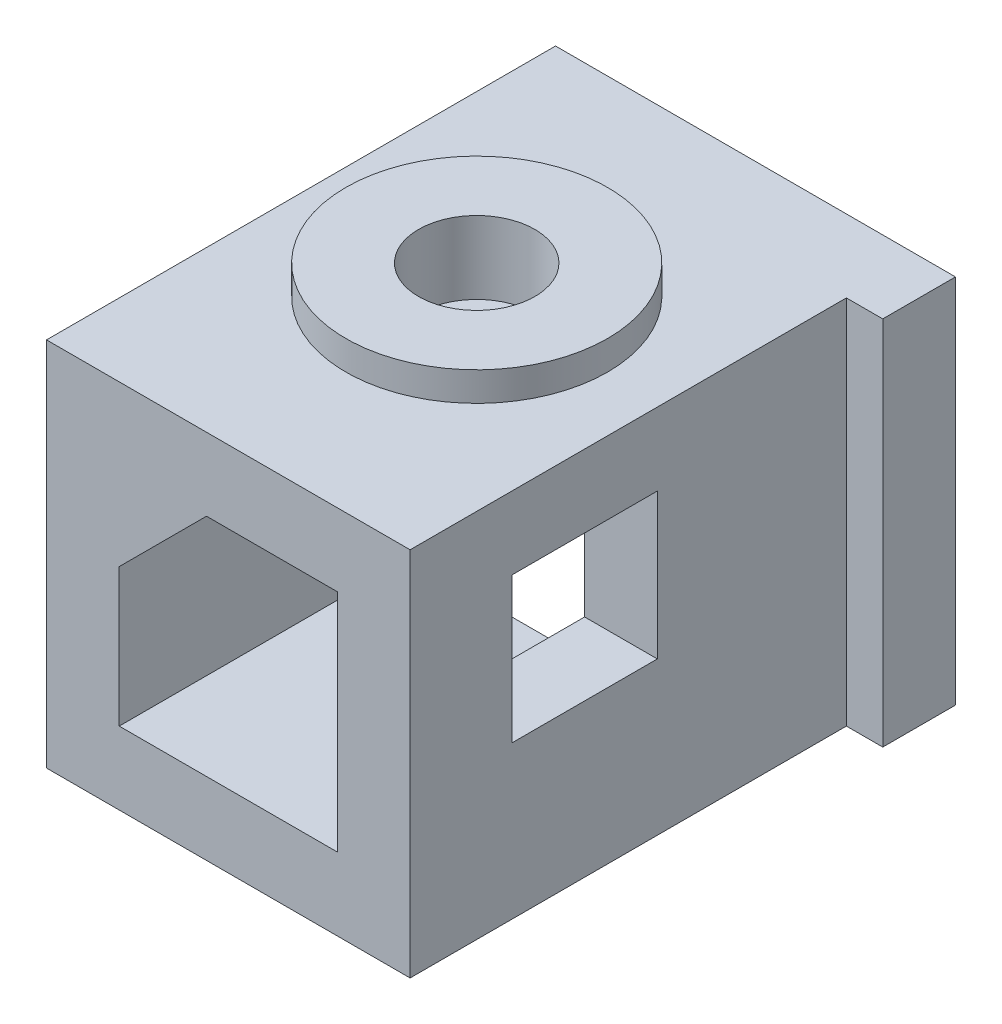
ISO-10303-21;
HEADER;
FILE_DESCRIPTION(('STEP AP214'),'2;1');
FILE_NAME('part.step','',(''),(''),'','','');
FILE_SCHEMA(('AUTOMOTIVE_DESIGN { 1 0 10303 214 1 1 1 1 }'));
ENDSEC;
DATA;
#1=APPLICATION_CONTEXT('core data for automotive mechanical design processes');
#2=APPLICATION_PROTOCOL_DEFINITION('international standard','automotive_design',2000,#1);
#3=PRODUCT_CONTEXT('',#1,'mechanical');
#4=PRODUCT('Part','Part','',(#3));
#5=PRODUCT_RELATED_PRODUCT_CATEGORY('part','',(#4));
#6=PRODUCT_DEFINITION_FORMATION('','',#4);
#7=PRODUCT_DEFINITION_CONTEXT('part definition',#1,'design');
#8=PRODUCT_DEFINITION('design','',#6,#7);
#9=PRODUCT_DEFINITION_SHAPE('','',#8);
#10=(LENGTH_UNIT() NAMED_UNIT(*) SI_UNIT(.MILLI.,.METRE.));
#11=(NAMED_UNIT(*) PLANE_ANGLE_UNIT() SI_UNIT($,.RADIAN.));
#12=(NAMED_UNIT(*) SI_UNIT($,.STERADIAN.) SOLID_ANGLE_UNIT());
#13=UNCERTAINTY_MEASURE_WITH_UNIT(LENGTH_MEASURE(1.E-05),#10,'distance_accuracy_value','');
#14=(GEOMETRIC_REPRESENTATION_CONTEXT(3) GLOBAL_UNCERTAINTY_ASSIGNED_CONTEXT((#13)) GLOBAL_UNIT_ASSIGNED_CONTEXT((#10,
#11,#12)) REPRESENTATION_CONTEXT('',''));
#15=CARTESIAN_POINT('',(0.,0.,0.));
#16=DIRECTION('',(0.,0.,1.));
#17=DIRECTION('',(1.,0.,0.));
#18=AXIS2_PLACEMENT_3D('',#15,#16,#17);
#19=CARTESIAN_POINT('',(-4.30557410186496,-6.26438847045866,35.));
#20=DIRECTION('',(-1.,0.,0.));
#21=DIRECTION('',(0.,-1.,0.));
#22=AXIS2_PLACEMENT_3D('',#19,#20,#21);
#23=PLANE('',#22);
#24=DIRECTION('',(0.,0.,1.));
#25=VECTOR('',#24,1.);
#26=CARTESIAN_POINT('',(-4.30557410186496,-15.7643884704587,35.));
#27=LINE('',#26,#25);
#28=CARTESIAN_POINT('',(-4.30557410186496,-15.7643884704587,15.));
#29=VERTEX_POINT('',#28);
#30=CARTESIAN_POINT('',(-4.30557410186496,-15.7643884704587,35.));
#31=VERTEX_POINT('',#30);
#32=EDGE_CURVE('E206',#29,#31,#27,.T.);
#33=ORIENTED_EDGE('',*,*,#32,.F.);
#34=DIRECTION('',(0.,1.,0.));
#35=VECTOR('',#34,1.);
#36=CARTESIAN_POINT('',(-4.30557410186496,-41.379916598547,15.));
#37=LINE('',#36,#35);
#38=CARTESIAN_POINT('',(-4.30557410186496,-13.2643884704587,15.));
#39=VERTEX_POINT('',#38);
#40=EDGE_CURVE('E241',#29,#39,#37,.T.);
#41=ORIENTED_EDGE('',*,*,#40,.T.);
#42=DIRECTION('',(0.,0.,-1.));
#43=VECTOR('',#42,1.);
#44=CARTESIAN_POINT('',(-4.30557410186496,-13.2643884704587,35.));
#45=LINE('',#44,#43);
#46=CARTESIAN_POINT('',(-4.30557410186496,-13.2643884704587,0.));
#47=VERTEX_POINT('',#46);
#48=EDGE_CURVE('E362',#39,#47,#45,.T.);
#49=ORIENTED_EDGE('',*,*,#48,.T.);
#50=DIRECTION('',(0.,1.,0.));
#51=VECTOR('',#50,1.);
#52=CARTESIAN_POINT('',(-4.30557410186496,-6.26438847045866,0.));
#53=LINE('',#52,#51);
#54=CARTESIAN_POINT('',(-4.30557410186496,-6.26438847045866,0.));
#55=VERTEX_POINT('',#54);
#56=EDGE_CURVE('E336',#47,#55,#53,.T.);
#57=ORIENTED_EDGE('',*,*,#56,.T.);
#58=DIRECTION('',(0.,0.,-1.));
#59=VECTOR('',#58,1.);
#60=CARTESIAN_POINT('',(-4.30557410186496,-6.26438847045866,35.));
#61=LINE('',#60,#59);
#62=CARTESIAN_POINT('',(-4.30557410186496,-6.26438847045866,35.));
#63=VERTEX_POINT('',#62);
#64=EDGE_CURVE('E359',#63,#55,#61,.T.);
#65=ORIENTED_EDGE('',*,*,#64,.F.);
#66=DIRECTION('',(0.,1.,0.));
#67=VECTOR('',#66,1.);
#68=CARTESIAN_POINT('',(-4.30557410186496,-6.26438847045866,35.));
#69=LINE('',#68,#67);
#70=EDGE_CURVE('E311',#31,#63,#69,.T.);
#71=ORIENTED_EDGE('',*,*,#70,.F.);
#72=EDGE_LOOP('',(#33,#41,#49,#57,#65,#71));
#73=FACE_BOUND('',#72,.T.);
#74=ADVANCED_FACE('F43',(#73),#23,.F.);
#75=CARTESIAN_POINT('',(10.694425898135,-20.7643884704587,35.));
#76=DIRECTION('',(1.,0.,0.));
#77=DIRECTION('',(0.,1.,0.));
#78=AXIS2_PLACEMENT_3D('',#75,#76,#77);
#79=PLANE('',#78);
#80=DIRECTION('',(0.,0.,1.));
#81=VECTOR('',#80,1.);
#82=CARTESIAN_POINT('',(10.694425898135,-10.2643884704587,28.));
#83=LINE('',#82,#81);
#84=CARTESIAN_POINT('',(10.694425898135,-10.2643884704587,18.));
#85=VERTEX_POINT('',#84);
#86=CARTESIAN_POINT('',(10.694425898135,-10.2643884704587,28.));
#87=VERTEX_POINT('',#86);
#88=EDGE_CURVE('E660',#85,#87,#83,.T.);
#89=ORIENTED_EDGE('',*,*,#88,.F.);
#90=DIRECTION('',(0.,-1.,0.));
#91=VECTOR('',#90,1.);
#92=CARTESIAN_POINT('',(10.694425898135,-0.264388470458658,18.));
#93=LINE('',#92,#91);
#94=CARTESIAN_POINT('',(10.694425898135,-0.264388470458662,18.));
#95=VERTEX_POINT('',#94);
#96=EDGE_CURVE('E227',#95,#85,#93,.T.);
#97=ORIENTED_EDGE('',*,*,#96,.F.);
#98=DIRECTION('',(0.,0.,-1.));
#99=VECTOR('',#98,1.);
#100=CARTESIAN_POINT('',(10.694425898135,-0.264388470458662,35.));
#101=LINE('',#100,#99);
#102=CARTESIAN_POINT('',(10.694425898135,-0.264388470458662,0.));
#103=VERTEX_POINT('',#102);
#104=EDGE_CURVE('E271',#95,#103,#101,.T.);
#105=ORIENTED_EDGE('',*,*,#104,.T.);
#106=DIRECTION('',(0.,1.,0.));
#107=VECTOR('',#106,1.);
#108=CARTESIAN_POINT('',(10.6944258981351,-20.7643884704587,0.));
#109=LINE('',#108,#107);
#110=CARTESIAN_POINT('',(10.6944258981351,-20.7643884704587,0.));
#111=VERTEX_POINT('',#110);
#112=EDGE_CURVE('E285',#111,#103,#109,.T.);
#113=ORIENTED_EDGE('',*,*,#112,.F.);
#114=DIRECTION('',(0.,0.,-1.));
#115=VECTOR('',#114,1.);
#116=CARTESIAN_POINT('',(10.694425898135,-20.7643884704587,35.));
#117=LINE('',#116,#115);
#118=CARTESIAN_POINT('',(10.694425898135,-20.7643884704587,15.));
#119=VERTEX_POINT('',#118);
#120=EDGE_CURVE('E279',#119,#111,#117,.T.);
#121=ORIENTED_EDGE('',*,*,#120,.F.);
#122=DIRECTION('',(0.,1.,0.));
#123=VECTOR('',#122,1.);
#124=CARTESIAN_POINT('',(10.694425898135,-20.7643884704587,15.));
#125=LINE('',#124,#123);
#126=CARTESIAN_POINT('',(10.694425898135,-15.7643884704587,15.));
#127=VERTEX_POINT('',#126);
#128=EDGE_CURVE('E212',#119,#127,#125,.T.);
#129=ORIENTED_EDGE('',*,*,#128,.T.);
#130=DIRECTION('',(0.,0.,1.));
#131=VECTOR('',#130,1.);
#132=CARTESIAN_POINT('',(10.694425898135,-15.7643884704587,35.));
#133=LINE('',#132,#131);
#134=CARTESIAN_POINT('',(10.694425898135,-15.7643884704587,35.));
#135=VERTEX_POINT('',#134);
#136=EDGE_CURVE('E210',#127,#135,#133,.T.);
#137=ORIENTED_EDGE('',*,*,#136,.T.);
#138=DIRECTION('',(0.,1.,0.));
#139=VECTOR('',#138,1.);
#140=CARTESIAN_POINT('',(10.694425898135,-20.7643884704587,35.));
#141=LINE('',#140,#139);
#142=CARTESIAN_POINT('',(10.694425898135,-0.264388470458662,35.));
#143=VERTEX_POINT('',#142);
#144=EDGE_CURVE('E291',#135,#143,#141,.T.);
#145=ORIENTED_EDGE('',*,*,#144,.T.);
#146=CARTESIAN_POINT('',(10.694425898135,-0.264388470458662,28.));
#147=VERTEX_POINT('',#146);
#148=EDGE_CURVE('E276',#143,#147,#101,.T.);
#149=ORIENTED_EDGE('',*,*,#148,.T.);
#150=DIRECTION('',(0.,1.,0.));
#151=VECTOR('',#150,1.);
#152=CARTESIAN_POINT('',(10.694425898135,-0.264388470458658,28.));
#153=LINE('',#152,#151);
#154=EDGE_CURVE('E176',#87,#147,#153,.T.);
#155=ORIENTED_EDGE('',*,*,#154,.F.);
#156=EDGE_LOOP('',(#89,#97,#105,#113,#121,#129,#137,#145,#149,#155));
#157=FACE_BOUND('',#156,.T.);
#158=ADVANCED_FACE('F400',(#157),#79,.F.);
#159=CARTESIAN_POINT('',(-4.30557410186496,-13.2643884704587,35.));
#160=DIRECTION('',(0.,1.,0.));
#161=DIRECTION('',(0.,0.,1.));
#162=AXIS2_PLACEMENT_3D('',#159,#160,#161);
#163=PLANE('',#162);
#164=DIRECTION('',(1.,0.,0.));
#165=VECTOR('',#164,1.);
#166=CARTESIAN_POINT('',(-9.30557410186496,-13.2643884704587,15.));
#167=LINE('',#166,#165);
#168=CARTESIAN_POINT('',(-9.30557410186496,-13.2643884704587,15.));
#169=VERTEX_POINT('',#168);
#170=EDGE_CURVE('E216',#169,#39,#167,.T.);
#171=ORIENTED_EDGE('',*,*,#170,.F.);
#172=DIRECTION('',(0.,0.,-1.));
#173=VECTOR('',#172,1.);
#174=CARTESIAN_POINT('',(-9.30557410186496,-13.2643884704587,35.));
#175=LINE('',#174,#173);
#176=CARTESIAN_POINT('',(-9.30557410186496,-13.2643884704587,0.));
#177=VERTEX_POINT('',#176);
#178=EDGE_CURVE('E47',#169,#177,#175,.T.);
#179=ORIENTED_EDGE('',*,*,#178,.T.);
#180=DIRECTION('',(1.,0.,0.));
#181=VECTOR('',#180,1.);
#182=CARTESIAN_POINT('',(-4.30557410186496,-13.2643884704587,0.));
#183=LINE('',#182,#181);
#184=EDGE_CURVE('E332',#177,#47,#183,.T.);
#185=ORIENTED_EDGE('',*,*,#184,.T.);
#186=ORIENTED_EDGE('',*,*,#48,.F.);
#187=EDGE_LOOP('',(#171,#179,#185,#186));
#188=FACE_BOUND('',#187,.T.);
#189=ADVANCED_FACE('F371',(#188),#163,.F.);
#190=CARTESIAN_POINT('',(15.694425898135,4.73561152954134,35.));
#191=DIRECTION('',(-1.,0.,0.));
#192=DIRECTION('',(0.,0.,1.));
#193=AXIS2_PLACEMENT_3D('',#190,#191,#192);
#194=PLANE('',#193);
#195=DIRECTION('',(0.,0.,1.));
#196=VECTOR('',#195,1.);
#197=CARTESIAN_POINT('',(15.694425898135,-0.264388470458662,28.));
#198=LINE('',#197,#196);
#199=CARTESIAN_POINT('',(15.694425898135,-0.264388470458662,18.));
#200=VERTEX_POINT('',#199);
#201=CARTESIAN_POINT('',(15.694425898135,-0.264388470458662,28.));
#202=VERTEX_POINT('',#201);
#203=EDGE_CURVE('E183',#200,#202,#198,.T.);
#204=ORIENTED_EDGE('',*,*,#203,.F.);
#205=DIRECTION('',(0.,1.,0.));
#206=VECTOR('',#205,1.);
#207=CARTESIAN_POINT('',(15.694425898135,-0.264388470458662,18.));
#208=LINE('',#207,#206);
#209=CARTESIAN_POINT('',(15.694425898135,-10.2643884704587,18.));
#210=VERTEX_POINT('',#209);
#211=EDGE_CURVE('E60',#210,#200,#208,.T.);
#212=ORIENTED_EDGE('',*,*,#211,.F.);
#213=DIRECTION('',(0.,0.,-1.));
#214=VECTOR('',#213,1.);
#215=CARTESIAN_POINT('',(15.694425898135,-10.2643884704587,28.));
#216=LINE('',#215,#214);
#217=CARTESIAN_POINT('',(15.694425898135,-10.2643884704587,28.));
#218=VERTEX_POINT('',#217);
#219=EDGE_CURVE('E192',#218,#210,#216,.T.);
#220=ORIENTED_EDGE('',*,*,#219,.F.);
#221=DIRECTION('',(0.,-1.,0.));
#222=VECTOR('',#221,1.);
#223=CARTESIAN_POINT('',(15.694425898135,-0.264388470458662,28.));
#224=LINE('',#223,#222);
#225=EDGE_CURVE('E173',#202,#218,#224,.T.);
#226=ORIENTED_EDGE('',*,*,#225,.F.);
#227=EDGE_LOOP('',(#204,#212,#220,#226));
#228=FACE_BOUND('',#227,.T.);
#229=DIRECTION('',(0.,-1.,0.));
#230=VECTOR('',#229,1.);
#231=CARTESIAN_POINT('',(15.694425898135,-20.7643884704587,5.));
#232=LINE('',#231,#230);
#233=CARTESIAN_POINT('',(15.694425898135,4.73561152954134,5.));
#234=VERTEX_POINT('',#233);
#235=CARTESIAN_POINT('',(15.694425898135,-20.7643884704587,5.));
#236=VERTEX_POINT('',#235);
#237=EDGE_CURVE('E237',#234,#236,#232,.T.);
#238=ORIENTED_EDGE('',*,*,#237,.F.);
#239=DIRECTION('',(0.,0.,-1.));
#240=VECTOR('',#239,1.);
#241=CARTESIAN_POINT('',(15.694425898135,4.73561152954134,35.));
#242=LINE('',#241,#240);
#243=CARTESIAN_POINT('',(15.694425898135,4.73561152954134,35.));
#244=VERTEX_POINT('',#243);
#245=EDGE_CURVE('E351',#244,#234,#242,.T.);
#246=ORIENTED_EDGE('',*,*,#245,.F.);
#247=DIRECTION('',(0.,1.,0.));
#248=VECTOR('',#247,1.);
#249=CARTESIAN_POINT('',(15.694425898135,4.73561152954134,35.));
#250=LINE('',#249,#248);
#251=CARTESIAN_POINT('',(15.694425898135,-20.7643884704587,35.));
#252=VERTEX_POINT('',#251);
#253=EDGE_CURVE('E322',#252,#244,#250,.T.);
#254=ORIENTED_EDGE('',*,*,#253,.F.);
#255=DIRECTION('',(0.,0.,1.));
#256=VECTOR('',#255,1.);
#257=CARTESIAN_POINT('',(15.694425898135,-20.7643884704587,35.));
#258=LINE('',#257,#256);
#259=EDGE_CURVE('E272',#236,#252,#258,.T.);
#260=ORIENTED_EDGE('',*,*,#259,.F.);
#261=EDGE_LOOP('',(#238,#246,#254,#260));
#262=FACE_BOUND('',#261,.T.);
#263=ADVANCED_FACE('F189',(#228,#262),#194,.F.);
#264=CARTESIAN_POINT('',(15.694425898135,-0.264388470458661,35.));
#265=DIRECTION('',(0.,1.,0.));
#266=DIRECTION('',(-1.,0.,0.));
#267=AXIS2_PLACEMENT_3D('',#264,#265,#266);
#268=PLANE('',#267);
#269=ORIENTED_EDGE('',*,*,#148,.F.);
#270=DIRECTION('',(1.,0.,0.));
#271=VECTOR('',#270,1.);
#272=CARTESIAN_POINT('',(15.694425898135,-0.264388470458661,35.));
#273=LINE('',#272,#271);
#274=CARTESIAN_POINT('',(1.69442589813504,-0.264388470458664,35.));
#275=VERTEX_POINT('',#274);
#276=EDGE_CURVE('E318',#275,#143,#273,.T.);
#277=ORIENTED_EDGE('',*,*,#276,.F.);
#278=DIRECTION('',(0.,0.,-1.));
#279=VECTOR('',#278,1.);
#280=CARTESIAN_POINT('',(1.69442589813504,-0.264388470458664,35.));
#281=LINE('',#280,#279);
#282=CARTESIAN_POINT('',(1.69442589813504,-0.264388470458664,0.));
#283=VERTEX_POINT('',#282);
#284=EDGE_CURVE('E355',#275,#283,#281,.T.);
#285=ORIENTED_EDGE('',*,*,#284,.T.);
#286=DIRECTION('',(1.,0.,0.));
#287=VECTOR('',#286,1.);
#288=CARTESIAN_POINT('',(15.694425898135,-0.264388470458661,0.));
#289=LINE('',#288,#287);
#290=EDGE_CURVE('E342',#283,#103,#289,.T.);
#291=ORIENTED_EDGE('',*,*,#290,.T.);
#292=ORIENTED_EDGE('',*,*,#104,.F.);
#293=DIRECTION('',(1.,0.,0.));
#294=VECTOR('',#293,1.);
#295=CARTESIAN_POINT('',(-3.4477097255959,-0.264388470458662,18.));
#296=LINE('',#295,#294);
#297=EDGE_CURVE('E180',#95,#200,#296,.T.);
#298=ORIENTED_EDGE('',*,*,#297,.T.);
#299=ORIENTED_EDGE('',*,*,#203,.T.);
#300=DIRECTION('',(1.,0.,0.));
#301=VECTOR('',#300,1.);
#302=CARTESIAN_POINT('',(-3.4477097255959,-0.264388470458662,28.));
#303=LINE('',#302,#301);
#304=EDGE_CURVE('E68',#147,#202,#303,.T.);
#305=ORIENTED_EDGE('',*,*,#304,.F.);
#306=EDGE_LOOP('',(#269,#277,#285,#291,#292,#298,#299,#305));
#307=FACE_BOUND('',#306,.T.);
#308=ADVANCED_FACE('F184',(#307),#268,.F.);
#309=CARTESIAN_POINT('',(-9.30557410186496,-13.2643884704587,35.));
#310=DIRECTION('',(1.,0.,0.));
#311=DIRECTION('',(0.,1.,0.));
#312=AXIS2_PLACEMENT_3D('',#309,#310,#311);
#313=PLANE('',#312);
#314=DIRECTION('',(0.,-1.,0.));
#315=VECTOR('',#314,1.);
#316=CARTESIAN_POINT('',(-9.30557410186496,-13.2643884704587,0.));
#317=LINE('',#316,#315);
#318=CARTESIAN_POINT('',(-9.30557410186496,4.73561152954134,0.));
#319=VERTEX_POINT('',#318);
#320=EDGE_CURVE('E305',#319,#177,#317,.T.);
#321=ORIENTED_EDGE('',*,*,#320,.T.);
#322=ORIENTED_EDGE('',*,*,#178,.F.);
#323=DIRECTION('',(0.,1.,0.));
#324=VECTOR('',#323,1.);
#325=CARTESIAN_POINT('',(-9.30557410186496,-41.379916598547,15.));
#326=LINE('',#325,#324);
#327=CARTESIAN_POINT('',(-9.30557410186496,-20.7643884704587,15.));
#328=VERTEX_POINT('',#327);
#329=EDGE_CURVE('E233',#328,#169,#326,.T.);
#330=ORIENTED_EDGE('',*,*,#329,.F.);
#331=DIRECTION('',(0.,0.,1.));
#332=VECTOR('',#331,1.);
#333=CARTESIAN_POINT('',(-9.30557410186496,-20.7643884704587,35.));
#334=LINE('',#333,#332);
#335=CARTESIAN_POINT('',(-9.30557410186496,-20.7643884704587,35.));
#336=VERTEX_POINT('',#335);
#337=EDGE_CURVE('E232',#328,#336,#334,.T.);
#338=ORIENTED_EDGE('',*,*,#337,.T.);
#339=DIRECTION('',(0.,-1.,0.));
#340=VECTOR('',#339,1.);
#341=CARTESIAN_POINT('',(-9.30557410186496,-13.2643884704587,35.));
#342=LINE('',#341,#340);
#343=CARTESIAN_POINT('',(-9.30557410186496,4.73561152954134,35.));
#344=VERTEX_POINT('',#343);
#345=EDGE_CURVE('E307',#344,#336,#342,.T.);
#346=ORIENTED_EDGE('',*,*,#345,.F.);
#347=DIRECTION('',(0.,0.,-1.));
#348=VECTOR('',#347,1.);
#349=CARTESIAN_POINT('',(-9.30557410186496,4.73561152954134,35.));
#350=LINE('',#349,#348);
#351=EDGE_CURVE('E328',#344,#319,#350,.T.);
#352=ORIENTED_EDGE('',*,*,#351,.T.);
#353=EDGE_LOOP('',(#321,#322,#330,#338,#346,#352));
#354=FACE_BOUND('',#353,.T.);
#355=ADVANCED_FACE('F45',(#354),#313,.F.);
#356=CARTESIAN_POINT('',(1.69442589813504,-0.264388470458664,35.));
#357=DIRECTION('',(-0.707106781186548,0.707106781186548,0.));
#358=DIRECTION('',(-0.707106781186548,-0.707106781186548,0.));
#359=AXIS2_PLACEMENT_3D('',#356,#357,#358);
#360=PLANE('',#359);
#361=DIRECTION('',(0.707106781186548,0.707106781186548,0.));
#362=VECTOR('',#361,1.);
#363=CARTESIAN_POINT('',(1.69442589813504,-0.264388470458664,0.));
#364=LINE('',#363,#362);
#365=EDGE_CURVE('E339',#55,#283,#364,.T.);
#366=ORIENTED_EDGE('',*,*,#365,.T.);
#367=ORIENTED_EDGE('',*,*,#284,.F.);
#368=DIRECTION('',(0.707106781186548,0.707106781186548,0.));
#369=VECTOR('',#368,1.);
#370=CARTESIAN_POINT('',(1.69442589813504,-0.264388470458664,35.));
#371=LINE('',#370,#369);
#372=EDGE_CURVE('E315',#63,#275,#371,.T.);
#373=ORIENTED_EDGE('',*,*,#372,.F.);
#374=ORIENTED_EDGE('',*,*,#64,.T.);
#375=EDGE_LOOP('',(#366,#367,#373,#374));
#376=FACE_BOUND('',#375,.T.);
#377=ADVANCED_FACE('F407',(#376),#360,.F.);
#378=CARTESIAN_POINT('',(-9.30557410186496,4.73561152954134,35.));
#379=DIRECTION('',(0.,-1.,0.));
#380=DIRECTION('',(1.,0.,0.));
#381=AXIS2_PLACEMENT_3D('',#378,#379,#380);
#382=PLANE('',#381);
#383=CARTESIAN_POINT('',(2.90442589813504,4.73561152954134,17.63));
#384=DIRECTION('',(0.,1.,0.));
#385=DIRECTION('',(-1.,0.,0.));
#386=AXIS2_PLACEMENT_3D('',#383,#384,#385);
#387=CIRCLE('',#386,9.);
#388=CARTESIAN_POINT('',(-6.09557410186496,4.73561152954134,17.63));
#389=VERTEX_POINT('',#388);
#390=EDGE_CURVE('E11',#389,#389,#387,.T.);
#391=ORIENTED_EDGE('',*,*,#390,.F.);
#392=EDGE_LOOP('',(#391));
#393=FACE_BOUND('',#392,.T.);
#394=DIRECTION('',(-1.,0.,0.));
#395=VECTOR('',#394,1.);
#396=CARTESIAN_POINT('',(-9.30557410186496,4.73561152954134,0.));
#397=LINE('',#396,#395);
#398=CARTESIAN_POINT('',(18.194425898135,4.73561152954134,0.));
#399=VERTEX_POINT('',#398);
#400=EDGE_CURVE('E312',#399,#319,#397,.T.);
#401=ORIENTED_EDGE('',*,*,#400,.T.);
#402=ORIENTED_EDGE('',*,*,#351,.F.);
#403=DIRECTION('',(-1.,0.,0.));
#404=VECTOR('',#403,1.);
#405=CARTESIAN_POINT('',(-9.30557410186496,4.73561152954134,35.));
#406=LINE('',#405,#404);
#407=EDGE_CURVE('E325',#244,#344,#406,.T.);
#408=ORIENTED_EDGE('',*,*,#407,.F.);
#409=ORIENTED_EDGE('',*,*,#245,.T.);
#410=DIRECTION('',(-1.,0.,0.));
#411=VECTOR('',#410,1.);
#412=CARTESIAN_POINT('',(18.194425898135,4.73561152954134,5.));
#413=LINE('',#412,#411);
#414=CARTESIAN_POINT('',(18.194425898135,4.73561152954134,5.));
#415=VERTEX_POINT('',#414);
#416=EDGE_CURVE('E267',#415,#234,#413,.T.);
#417=ORIENTED_EDGE('',*,*,#416,.F.);
#418=DIRECTION('',(0.,0.,1.));
#419=VECTOR('',#418,1.);
#420=CARTESIAN_POINT('',(18.194425898135,4.73561152954134,0.));
#421=LINE('',#420,#419);
#422=EDGE_CURVE('E250',#399,#415,#421,.T.);
#423=ORIENTED_EDGE('',*,*,#422,.F.);
#424=EDGE_LOOP('',(#401,#402,#408,#409,#417,#423));
#425=FACE_BOUND('',#424,.T.);
#426=ADVANCED_FACE('F383',(#393,#425),#382,.F.);
#427=CARTESIAN_POINT('',(0.,0.,35.));
#428=DIRECTION('',(0.,0.,-1.));
#429=DIRECTION('',(-1.,0.,0.));
#430=AXIS2_PLACEMENT_3D('',#427,#428,#429);
#431=PLANE('',#430);
#432=DIRECTION('',(-1.,0.,0.));
#433=VECTOR('',#432,1.);
#434=CARTESIAN_POINT('',(31.3099540262233,-15.7643884704587,35.));
#435=LINE('',#434,#433);
#436=EDGE_CURVE('E223',#135,#31,#435,.T.);
#437=ORIENTED_EDGE('',*,*,#436,.T.);
#438=ORIENTED_EDGE('',*,*,#70,.T.);
#439=ORIENTED_EDGE('',*,*,#372,.T.);
#440=ORIENTED_EDGE('',*,*,#276,.T.);
#441=ORIENTED_EDGE('',*,*,#144,.F.);
#442=EDGE_LOOP('',(#437,#438,#439,#440,#441));
#443=FACE_BOUND('',#442,.T.);
#444=ORIENTED_EDGE('',*,*,#345,.T.);
#445=DIRECTION('',(-1.,0.,0.));
#446=VECTOR('',#445,1.);
#447=CARTESIAN_POINT('',(15.694425898135,-20.7643884704587,35.));
#448=LINE('',#447,#446);
#449=EDGE_CURVE('E275',#252,#336,#448,.T.);
#450=ORIENTED_EDGE('',*,*,#449,.F.);
#451=ORIENTED_EDGE('',*,*,#253,.T.);
#452=ORIENTED_EDGE('',*,*,#407,.T.);
#453=EDGE_LOOP('',(#444,#450,#451,#452));
#454=FACE_BOUND('',#453,.T.);
#455=ADVANCED_FACE('F412',(#443,#454),#431,.F.);
#456=CARTESIAN_POINT('',(0.,0.,0.));
#457=DIRECTION('',(0.,0.,-1.));
#458=DIRECTION('',(-1.,0.,0.));
#459=AXIS2_PLACEMENT_3D('',#456,#457,#458);
#460=PLANE('',#459);
#461=ORIENTED_EDGE('',*,*,#320,.F.);
#462=ORIENTED_EDGE('',*,*,#400,.F.);
#463=DIRECTION('',(0.,1.,0.));
#464=VECTOR('',#463,1.);
#465=CARTESIAN_POINT('',(18.194425898135,-20.7643884704587,0.));
#466=LINE('',#465,#464);
#467=CARTESIAN_POINT('',(18.194425898135,-20.7643884704587,0.));
#468=VERTEX_POINT('',#467);
#469=EDGE_CURVE('E246',#468,#399,#466,.T.);
#470=ORIENTED_EDGE('',*,*,#469,.F.);
#471=DIRECTION('',(1.,0.,0.));
#472=VECTOR('',#471,1.);
#473=CARTESIAN_POINT('',(15.694425898135,-20.7643884704587,0.));
#474=LINE('',#473,#472);
#475=EDGE_CURVE('E282',#111,#468,#474,.T.);
#476=ORIENTED_EDGE('',*,*,#475,.F.);
#477=ORIENTED_EDGE('',*,*,#112,.T.);
#478=ORIENTED_EDGE('',*,*,#290,.F.);
#479=ORIENTED_EDGE('',*,*,#365,.F.);
#480=ORIENTED_EDGE('',*,*,#56,.F.);
#481=ORIENTED_EDGE('',*,*,#184,.F.);
#482=EDGE_LOOP('',(#461,#462,#470,#476,#477,#478,#479,#480,#481));
#483=FACE_BOUND('',#482,.T.);
#484=ADVANCED_FACE('F377',(#483),#460,.T.);
#485=CARTESIAN_POINT('',(2.90442589813504,6.73561152954134,17.63));
#486=DIRECTION('',(0.,-1.,0.));
#487=DIRECTION('',(1.,0.,0.));
#488=AXIS2_PLACEMENT_3D('',#485,#486,#487);
#489=CYLINDRICAL_SURFACE('',#488,9.);
#490=CARTESIAN_POINT('',(2.90442589813504,6.73561152954134,17.63));
#491=DIRECTION('',(0.,1.,0.));
#492=DIRECTION('',(-1.,0.,0.));
#493=AXIS2_PLACEMENT_3D('',#490,#491,#492);
#494=CIRCLE('',#493,9.);
#495=CARTESIAN_POINT('',(-6.09557410186496,6.73561152954134,17.63));
#496=VERTEX_POINT('',#495);
#497=EDGE_CURVE('E299',#496,#496,#494,.T.);
#498=ORIENTED_EDGE('',*,*,#497,.F.);
#499=EDGE_LOOP('',(#498));
#500=FACE_BOUND('',#499,.T.);
#501=ORIENTED_EDGE('',*,*,#390,.T.);
#502=EDGE_LOOP('',(#501));
#503=FACE_BOUND('',#502,.T.);
#504=ADVANCED_FACE('F460',(#500,#503),#489,.T.);
#505=CARTESIAN_POINT('',(2.90442589813504,6.73561152954134,17.63));
#506=DIRECTION('',(0.,1.,0.));
#507=DIRECTION('',(-1.,0.,0.));
#508=AXIS2_PLACEMENT_3D('',#505,#506,#507);
#509=PLANE('',#508);
#510=CARTESIAN_POINT('',(2.90442589813504,6.73561152954134,17.63));
#511=DIRECTION('',(0.,1.,0.));
#512=DIRECTION('',(-1.,0.,0.));
#513=AXIS2_PLACEMENT_3D('',#510,#511,#512);
#514=CIRCLE('',#513,4.);
#515=CARTESIAN_POINT('',(-1.09557410186496,6.73561152954134,17.63));
#516=VERTEX_POINT('',#515);
#517=EDGE_CURVE('E294',#516,#516,#514,.T.);
#518=ORIENTED_EDGE('',*,*,#517,.F.);
#519=EDGE_LOOP('',(#518));
#520=FACE_BOUND('',#519,.T.);
#521=ORIENTED_EDGE('',*,*,#497,.T.);
#522=EDGE_LOOP('',(#521));
#523=FACE_BOUND('',#522,.T.);
#524=ADVANCED_FACE('F465',(#520,#523),#509,.T.);
#525=CARTESIAN_POINT('',(2.90442589813504,1.73561152954134,17.63));
#526=DIRECTION('',(0.,1.,0.));
#527=DIRECTION('',(-1.,0.,0.));
#528=AXIS2_PLACEMENT_3D('',#525,#526,#527);
#529=CYLINDRICAL_SURFACE('',#528,4.);
#530=CARTESIAN_POINT('',(2.90442589813504,1.73561152954134,17.63));
#531=DIRECTION('',(0.,1.,0.));
#532=DIRECTION('',(-1.,0.,0.));
#533=AXIS2_PLACEMENT_3D('',#530,#531,#532);
#534=CIRCLE('',#533,4.);
#535=CARTESIAN_POINT('',(-1.09557410186496,1.73561152954134,17.63));
#536=VERTEX_POINT('',#535);
#537=EDGE_CURVE('E295',#536,#536,#534,.T.);
#538=ORIENTED_EDGE('',*,*,#537,.F.);
#539=EDGE_LOOP('',(#538));
#540=FACE_BOUND('',#539,.T.);
#541=ORIENTED_EDGE('',*,*,#517,.T.);
#542=EDGE_LOOP('',(#541));
#543=FACE_BOUND('',#542,.T.);
#544=ADVANCED_FACE('F469',(#540,#543),#529,.F.);
#545=CARTESIAN_POINT('',(2.90442589813504,1.73561152954134,17.63));
#546=DIRECTION('',(0.,1.,0.));
#547=DIRECTION('',(-1.,0.,0.));
#548=AXIS2_PLACEMENT_3D('',#545,#546,#547);
#549=PLANE('',#548);
#550=ORIENTED_EDGE('',*,*,#537,.T.);
#551=EDGE_LOOP('',(#550));
#552=FACE_BOUND('',#551,.T.);
#553=ADVANCED_FACE('F431',(#552),#549,.T.);
#554=CARTESIAN_POINT('',(0.,-20.7643884704587,0.));
#555=DIRECTION('',(0.,1.,0.));
#556=DIRECTION('',(-1.,0.,0.));
#557=AXIS2_PLACEMENT_3D('',#554,#555,#556);
#558=PLANE('',#557);
#559=ORIENTED_EDGE('',*,*,#475,.T.);
#560=DIRECTION('',(0.,0.,-1.));
#561=VECTOR('',#560,1.);
#562=CARTESIAN_POINT('',(18.194425898135,-20.7643884704587,0.));
#563=LINE('',#562,#561);
#564=CARTESIAN_POINT('',(18.194425898135,-20.7643884704587,5.));
#565=VERTEX_POINT('',#564);
#566=EDGE_CURVE('E256',#565,#468,#563,.T.);
#567=ORIENTED_EDGE('',*,*,#566,.F.);
#568=DIRECTION('',(-1.,0.,0.));
#569=VECTOR('',#568,1.);
#570=CARTESIAN_POINT('',(18.194425898135,-20.7643884704587,5.));
#571=LINE('',#570,#569);
#572=EDGE_CURVE('E260',#565,#236,#571,.T.);
#573=ORIENTED_EDGE('',*,*,#572,.T.);
#574=ORIENTED_EDGE('',*,*,#259,.T.);
#575=ORIENTED_EDGE('',*,*,#449,.T.);
#576=ORIENTED_EDGE('',*,*,#337,.F.);
#577=DIRECTION('',(-1.,0.,0.));
#578=VECTOR('',#577,1.);
#579=CARTESIAN_POINT('',(-9.30557410186496,-20.7643884704587,15.));
#580=LINE('',#579,#578);
#581=EDGE_CURVE('E228',#119,#328,#580,.T.);
#582=ORIENTED_EDGE('',*,*,#581,.F.);
#583=ORIENTED_EDGE('',*,*,#120,.T.);
#584=EDGE_LOOP('',(#559,#567,#573,#574,#575,#576,#582,#583));
#585=FACE_BOUND('',#584,.T.);
#586=ADVANCED_FACE('F394',(#585),#558,.F.);
#587=CARTESIAN_POINT('',(18.194425898135,-20.7643884704587,5.));
#588=DIRECTION('',(0.,0.,-1.));
#589=DIRECTION('',(-1.,0.,0.));
#590=AXIS2_PLACEMENT_3D('',#587,#588,#589);
#591=PLANE('',#590);
#592=ORIENTED_EDGE('',*,*,#237,.T.);
#593=ORIENTED_EDGE('',*,*,#572,.F.);
#594=DIRECTION('',(0.,-1.,0.));
#595=VECTOR('',#594,1.);
#596=CARTESIAN_POINT('',(18.194425898135,-20.7643884704587,5.));
#597=LINE('',#596,#595);
#598=EDGE_CURVE('E253',#415,#565,#597,.T.);
#599=ORIENTED_EDGE('',*,*,#598,.F.);
#600=ORIENTED_EDGE('',*,*,#416,.T.);
#601=EDGE_LOOP('',(#592,#593,#599,#600));
#602=FACE_BOUND('',#601,.T.);
#603=ADVANCED_FACE('F423',(#602),#591,.F.);
#604=CARTESIAN_POINT('',(18.194425898135,0.,0.));
#605=DIRECTION('',(1.,0.,0.));
#606=DIRECTION('',(0.,0.,-1.));
#607=AXIS2_PLACEMENT_3D('',#604,#605,#606);
#608=PLANE('',#607);
#609=ORIENTED_EDGE('',*,*,#469,.T.);
#610=ORIENTED_EDGE('',*,*,#422,.T.);
#611=ORIENTED_EDGE('',*,*,#598,.T.);
#612=ORIENTED_EDGE('',*,*,#566,.T.);
#613=EDGE_LOOP('',(#609,#610,#611,#612));
#614=FACE_BOUND('',#613,.T.);
#615=ADVANCED_FACE('F389',(#614),#608,.T.);
#616=CARTESIAN_POINT('',(-9.30557410186496,-41.379916598547,15.));
#617=DIRECTION('',(0.,0.,1.));
#618=DIRECTION('',(1.,0.,0.));
#619=AXIS2_PLACEMENT_3D('',#616,#617,#618);
#620=PLANE('',#619);
#621=ORIENTED_EDGE('',*,*,#40,.F.);
#622=DIRECTION('',(-1.,0.,0.));
#623=VECTOR('',#622,1.);
#624=CARTESIAN_POINT('',(31.3099540262233,-15.7643884704587,15.));
#625=LINE('',#624,#623);
#626=EDGE_CURVE('E211',#127,#29,#625,.T.);
#627=ORIENTED_EDGE('',*,*,#626,.F.);
#628=ORIENTED_EDGE('',*,*,#128,.F.);
#629=ORIENTED_EDGE('',*,*,#581,.T.);
#630=ORIENTED_EDGE('',*,*,#329,.T.);
#631=ORIENTED_EDGE('',*,*,#170,.T.);
#632=EDGE_LOOP('',(#621,#627,#628,#629,#630,#631));
#633=FACE_BOUND('',#632,.T.);
#634=ADVANCED_FACE('F418',(#633),#620,.F.);
#635=CARTESIAN_POINT('',(31.3099540262233,-15.7643884704587,35.));
#636=DIRECTION('',(0.,-1.,0.));
#637=DIRECTION('',(1.,0.,0.));
#638=AXIS2_PLACEMENT_3D('',#635,#636,#637);
#639=PLANE('',#638);
#640=ORIENTED_EDGE('',*,*,#136,.F.);
#641=ORIENTED_EDGE('',*,*,#626,.T.);
#642=ORIENTED_EDGE('',*,*,#32,.T.);
#643=ORIENTED_EDGE('',*,*,#436,.F.);
#644=EDGE_LOOP('',(#640,#641,#642,#643));
#645=FACE_BOUND('',#644,.T.);
#646=ADVANCED_FACE('F416',(#645),#639,.F.);
#647=CARTESIAN_POINT('',(-3.4477097255959,-0.264388470458662,18.));
#648=DIRECTION('',(0.,0.,-1.));
#649=DIRECTION('',(0.,1.,0.));
#650=AXIS2_PLACEMENT_3D('',#647,#648,#649);
#651=PLANE('',#650);
#652=ORIENTED_EDGE('',*,*,#96,.T.);
#653=DIRECTION('',(1.,0.,0.));
#654=VECTOR('',#653,1.);
#655=CARTESIAN_POINT('',(-3.4477097255959,-10.2643884704587,18.));
#656=LINE('',#655,#654);
#657=EDGE_CURVE('E199',#85,#210,#656,.T.);
#658=ORIENTED_EDGE('',*,*,#657,.T.);
#659=ORIENTED_EDGE('',*,*,#211,.T.);
#660=ORIENTED_EDGE('',*,*,#297,.F.);
#661=EDGE_LOOP('',(#652,#658,#659,#660));
#662=FACE_BOUND('',#661,.T.);
#663=ADVANCED_FACE('F513',(#662),#651,.F.);
#664=CARTESIAN_POINT('',(-3.4477097255959,-10.2643884704587,28.));
#665=DIRECTION('',(0.,-1.,0.));
#666=DIRECTION('',(0.,0.,-1.));
#667=AXIS2_PLACEMENT_3D('',#664,#665,#666);
#668=PLANE('',#667);
#669=ORIENTED_EDGE('',*,*,#88,.T.);
#670=DIRECTION('',(1.,0.,0.));
#671=VECTOR('',#670,1.);
#672=CARTESIAN_POINT('',(-3.4477097255959,-10.2643884704587,28.));
#673=LINE('',#672,#671);
#674=EDGE_CURVE('E179',#87,#218,#673,.T.);
#675=ORIENTED_EDGE('',*,*,#674,.T.);
#676=ORIENTED_EDGE('',*,*,#219,.T.);
#677=ORIENTED_EDGE('',*,*,#657,.F.);
#678=EDGE_LOOP('',(#669,#675,#676,#677));
#679=FACE_BOUND('',#678,.T.);
#680=ADVANCED_FACE('F638',(#679),#668,.F.);
#681=CARTESIAN_POINT('',(-3.4477097255959,-0.264388470458662,28.));
#682=DIRECTION('',(0.,0.,1.));
#683=DIRECTION('',(1.,0.,0.));
#684=AXIS2_PLACEMENT_3D('',#681,#682,#683);
#685=PLANE('',#684);
#686=ORIENTED_EDGE('',*,*,#154,.T.);
#687=ORIENTED_EDGE('',*,*,#304,.T.);
#688=ORIENTED_EDGE('',*,*,#225,.T.);
#689=ORIENTED_EDGE('',*,*,#674,.F.);
#690=EDGE_LOOP('',(#686,#687,#688,#689));
#691=FACE_BOUND('',#690,.T.);
#692=ADVANCED_FACE('F170',(#691),#685,.F.);
#693=CLOSED_SHELL('',(#74,#158,#189,#263,#308,#355,#377,#426,#455,#484,#504,#524,#544,#553,#586,
#603,#615,#634,#646,#663,#680,#692));
#694=MANIFOLD_SOLID_BREP('B2',#693);
#695=ADVANCED_BREP_SHAPE_REPRESENTATION('',(#18,#694),#14);
#696=SHAPE_DEFINITION_REPRESENTATION(#9,#695);
ENDSEC;
END-ISO-10303-21;
